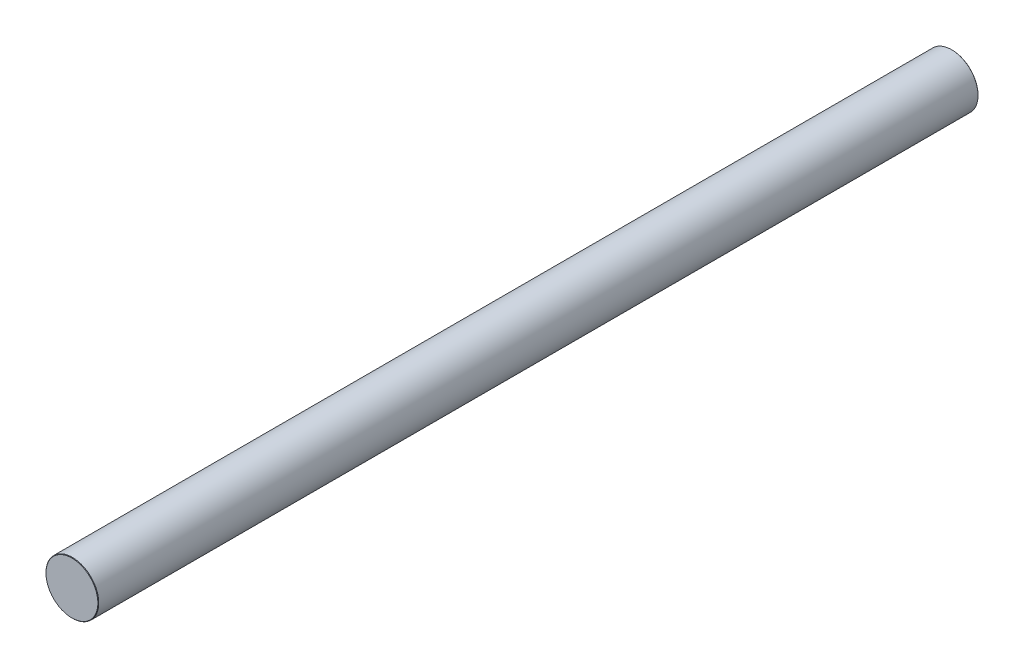
ISO-10303-21;
HEADER;
FILE_DESCRIPTION(('STEP AP214'),'2;1');
FILE_NAME('part.step','',(''),(''),'','','');
FILE_SCHEMA(('AUTOMOTIVE_DESIGN { 1 0 10303 214 1 1 1 1 }'));
ENDSEC;
DATA;
#1=APPLICATION_CONTEXT('core data for automotive mechanical design processes');
#2=APPLICATION_PROTOCOL_DEFINITION('international standard','automotive_design',2000,#1);
#3=PRODUCT_CONTEXT('',#1,'mechanical');
#4=PRODUCT('Part','Part','',(#3));
#5=PRODUCT_RELATED_PRODUCT_CATEGORY('part','',(#4));
#6=PRODUCT_DEFINITION_FORMATION('','',#4);
#7=PRODUCT_DEFINITION_CONTEXT('part definition',#1,'design');
#8=PRODUCT_DEFINITION('design','',#6,#7);
#9=PRODUCT_DEFINITION_SHAPE('','',#8);
#10=(LENGTH_UNIT() NAMED_UNIT(*) SI_UNIT(.MILLI.,.METRE.));
#11=(NAMED_UNIT(*) PLANE_ANGLE_UNIT() SI_UNIT($,.RADIAN.));
#12=(NAMED_UNIT(*) SI_UNIT($,.STERADIAN.) SOLID_ANGLE_UNIT());
#13=UNCERTAINTY_MEASURE_WITH_UNIT(LENGTH_MEASURE(1.E-05),#10,'distance_accuracy_value','');
#14=(GEOMETRIC_REPRESENTATION_CONTEXT(3) GLOBAL_UNCERTAINTY_ASSIGNED_CONTEXT((#13)) GLOBAL_UNIT_ASSIGNED_CONTEXT((#10,
#11,#12)) REPRESENTATION_CONTEXT('',''));
#15=CARTESIAN_POINT('',(0.,0.,0.));
#16=DIRECTION('',(0.,0.,1.));
#17=DIRECTION('',(1.,0.,0.));
#18=AXIS2_PLACEMENT_3D('',#15,#16,#17);
#19=CARTESIAN_POINT('',(0.,0.,200.));
#20=DIRECTION('',(0.,0.,-1.));
#21=DIRECTION('',(-1.,0.,0.));
#22=AXIS2_PLACEMENT_3D('',#19,#20,#21);
#23=CYLINDRICAL_SURFACE('',#22,6.);
#24=CARTESIAN_POINT('',(0.,0.,0.100000000000017));
#25=DIRECTION('',(0.,0.,1.));
#26=DIRECTION('',(1.,0.,0.));
#27=AXIS2_PLACEMENT_3D('',#24,#25,#26);
#28=CIRCLE('',#27,6.);
#29=CARTESIAN_POINT('',(6.,0.,0.100000000000017));
#30=VERTEX_POINT('',#29);
#31=EDGE_CURVE('E45',#30,#30,#28,.T.);
#32=ORIENTED_EDGE('',*,*,#31,.T.);
#33=EDGE_LOOP('',(#32));
#34=FACE_BOUND('',#33,.T.);
#35=CARTESIAN_POINT('',(0.,0.,199.9));
#36=DIRECTION('',(0.,0.,1.));
#37=DIRECTION('',(1.,0.,0.));
#38=AXIS2_PLACEMENT_3D('',#35,#36,#37);
#39=CIRCLE('',#38,6.);
#40=CARTESIAN_POINT('',(6.,0.,199.9));
#41=VERTEX_POINT('',#40);
#42=EDGE_CURVE('E49',#41,#41,#39,.F.);
#43=ORIENTED_EDGE('',*,*,#42,.T.);
#44=EDGE_LOOP('',(#43));
#45=FACE_BOUND('',#44,.T.);
#46=ADVANCED_FACE('F34',(#34,#45),#23,.T.);
#47=CARTESIAN_POINT('',(0.,0.,200.));
#48=DIRECTION('',(0.,0.,1.));
#49=DIRECTION('',(1.,0.,0.));
#50=AXIS2_PLACEMENT_3D('',#47,#48,#49);
#51=PLANE('',#50);
#52=CARTESIAN_POINT('',(0.,0.,200.));
#53=DIRECTION('',(0.,0.,1.));
#54=DIRECTION('',(1.,0.,0.));
#55=AXIS2_PLACEMENT_3D('',#52,#53,#54);
#56=CIRCLE('',#55,5.89999999999999);
#57=CARTESIAN_POINT('',(5.89999999999999,0.,200.));
#58=VERTEX_POINT('',#57);
#59=EDGE_CURVE('E10',#58,#58,#56,.T.);
#60=ORIENTED_EDGE('',*,*,#59,.T.);
#61=EDGE_LOOP('',(#60));
#62=FACE_BOUND('',#61,.T.);
#63=ADVANCED_FACE('F65',(#62),#51,.T.);
#64=CARTESIAN_POINT('',(0.,0.,0.));
#65=DIRECTION('',(0.,0.,1.));
#66=DIRECTION('',(1.,0.,0.));
#67=AXIS2_PLACEMENT_3D('',#64,#65,#66);
#68=PLANE('',#67);
#69=CARTESIAN_POINT('',(0.,0.,0.));
#70=DIRECTION('',(0.,0.,1.));
#71=DIRECTION('',(1.,0.,0.));
#72=AXIS2_PLACEMENT_3D('',#69,#70,#71);
#73=CIRCLE('',#72,5.89999999999996);
#74=CARTESIAN_POINT('',(5.89999999999996,0.,0.));
#75=VERTEX_POINT('',#74);
#76=EDGE_CURVE('E41',#75,#75,#73,.F.);
#77=ORIENTED_EDGE('',*,*,#76,.T.);
#78=EDGE_LOOP('',(#77));
#79=FACE_BOUND('',#78,.T.);
#80=ADVANCED_FACE('F62',(#79),#68,.F.);
#81=CARTESIAN_POINT('',(0.,0.,0.100000000000017));
#82=DIRECTION('',(0.,0.,1.));
#83=DIRECTION('',(1.,0.,0.));
#84=AXIS2_PLACEMENT_3D('',#81,#82,#83);
#85=CONICAL_SURFACE('',#84,6.,0.785398163397561);
#86=ORIENTED_EDGE('',*,*,#76,.F.);
#87=EDGE_LOOP('',(#86));
#88=FACE_BOUND('',#87,.T.);
#89=ORIENTED_EDGE('',*,*,#31,.F.);
#90=EDGE_LOOP('',(#89));
#91=FACE_BOUND('',#90,.T.);
#92=ADVANCED_FACE('F58',(#88,#91),#85,.T.);
#93=CARTESIAN_POINT('',(0.,0.,200.));
#94=DIRECTION('',(0.,0.,-1.));
#95=DIRECTION('',(-1.,0.,0.));
#96=AXIS2_PLACEMENT_3D('',#93,#94,#95);
#97=CONICAL_SURFACE('',#96,5.89999999999999,0.785398163397427);
#98=ORIENTED_EDGE('',*,*,#42,.F.);
#99=EDGE_LOOP('',(#98));
#100=FACE_BOUND('',#99,.T.);
#101=ORIENTED_EDGE('',*,*,#59,.F.);
#102=EDGE_LOOP('',(#101));
#103=FACE_BOUND('',#102,.T.);
#104=ADVANCED_FACE('F36',(#100,#103),#97,.T.);
#105=CLOSED_SHELL('',(#46,#63,#80,#92,#104));
#106=MANIFOLD_SOLID_BREP('B2',#105);
#107=ADVANCED_BREP_SHAPE_REPRESENTATION('',(#18,#106),#14);
#108=SHAPE_DEFINITION_REPRESENTATION(#9,#107);
ENDSEC;
END-ISO-10303-21;
